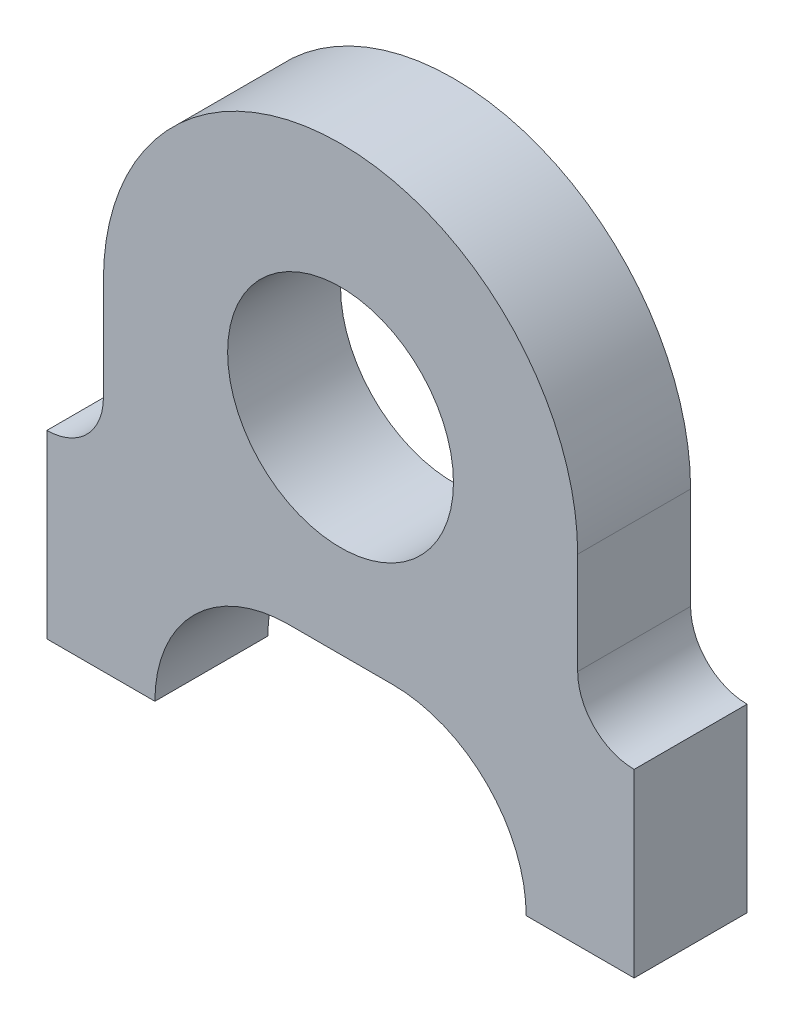
ISO-10303-21;
HEADER;
FILE_DESCRIPTION(('STEP AP214'),'2;1');
FILE_NAME('part.step','',(''),(''),'','','');
FILE_SCHEMA(('AUTOMOTIVE_DESIGN { 1 0 10303 214 1 1 1 1 }'));
ENDSEC;
DATA;
#1=APPLICATION_CONTEXT('core data for automotive mechanical design processes');
#2=APPLICATION_PROTOCOL_DEFINITION('international standard','automotive_design',2000,#1);
#3=PRODUCT_CONTEXT('',#1,'mechanical');
#4=PRODUCT('Part','Part','',(#3));
#5=PRODUCT_RELATED_PRODUCT_CATEGORY('part','',(#4));
#6=PRODUCT_DEFINITION_FORMATION('','',#4);
#7=PRODUCT_DEFINITION_CONTEXT('part definition',#1,'design');
#8=PRODUCT_DEFINITION('design','',#6,#7);
#9=PRODUCT_DEFINITION_SHAPE('','',#8);
#10=(LENGTH_UNIT() NAMED_UNIT(*) SI_UNIT(.MILLI.,.METRE.));
#11=(NAMED_UNIT(*) PLANE_ANGLE_UNIT() SI_UNIT($,.RADIAN.));
#12=(NAMED_UNIT(*) SI_UNIT($,.STERADIAN.) SOLID_ANGLE_UNIT());
#13=UNCERTAINTY_MEASURE_WITH_UNIT(LENGTH_MEASURE(1.E-05),#10,'distance_accuracy_value','');
#14=(GEOMETRIC_REPRESENTATION_CONTEXT(3) GLOBAL_UNCERTAINTY_ASSIGNED_CONTEXT((#13)) GLOBAL_UNIT_ASSIGNED_CONTEXT((#10,
#11,#12)) REPRESENTATION_CONTEXT('',''));
#15=CARTESIAN_POINT('',(0.,0.,0.));
#16=DIRECTION('',(0.,0.,1.));
#17=DIRECTION('',(1.,0.,0.));
#18=AXIS2_PLACEMENT_3D('',#15,#16,#17);
#19=CARTESIAN_POINT('',(-16.51,-5.71499999999999,6.35));
#20=DIRECTION('',(0.,0.,1.));
#21=DIRECTION('',(1.,0.,0.));
#22=AXIS2_PLACEMENT_3D('',#19,#20,#21);
#23=PLANE('',#22);
#24=CARTESIAN_POINT('',(-16.51,-5.71499999999999,6.35));
#25=DIRECTION('',(0.,0.,-1.));
#26=DIRECTION('',(1.,0.,0.));
#27=AXIS2_PLACEMENT_3D('',#24,#25,#26);
#28=CIRCLE('',#27,3.17500000000001);
#29=CARTESIAN_POINT('',(-13.335,-5.71499999999999,6.35));
#30=VERTEX_POINT('',#29);
#31=CARTESIAN_POINT('',(-16.51,-8.89,6.35));
#32=VERTEX_POINT('',#31);
#33=EDGE_CURVE('E181',#30,#32,#28,.T.);
#34=ORIENTED_EDGE('',*,*,#33,.T.);
#35=DIRECTION('',(0.,-1.,0.));
#36=VECTOR('',#35,1.);
#37=CARTESIAN_POINT('',(-16.51,-8.89,6.35));
#38=LINE('',#37,#36);
#39=CARTESIAN_POINT('',(-16.51,-19.05,6.35));
#40=VERTEX_POINT('',#39);
#41=EDGE_CURVE('E107',#32,#40,#38,.T.);
#42=ORIENTED_EDGE('',*,*,#41,.T.);
#43=DIRECTION('',(1.,0.,0.));
#44=VECTOR('',#43,1.);
#45=CARTESIAN_POINT('',(-16.51,-19.05,6.35));
#46=LINE('',#45,#44);
#47=CARTESIAN_POINT('',(-10.4394,-19.05,6.35));
#48=VERTEX_POINT('',#47);
#49=EDGE_CURVE('E208',#40,#48,#46,.T.);
#50=ORIENTED_EDGE('',*,*,#49,.T.);
#51=CARTESIAN_POINT('',(-2.93763032034358,-19.05,6.35));
#52=DIRECTION('',(0.,0.,-1.));
#53=DIRECTION('',(-1.,0.,0.));
#54=AXIS2_PLACEMENT_3D('',#51,#52,#53);
#55=CIRCLE('',#54,7.50176967965642);
#56=CARTESIAN_POINT('',(-2.93763032034358,-11.5482303203436,6.35));
#57=VERTEX_POINT('',#56);
#58=EDGE_CURVE('E227',#48,#57,#55,.T.);
#59=ORIENTED_EDGE('',*,*,#58,.T.);
#60=DIRECTION('',(1.,0.,0.));
#61=VECTOR('',#60,1.);
#62=CARTESIAN_POINT('',(-2.93763032034358,-11.5482303203436,6.35));
#63=LINE('',#62,#61);
#64=CARTESIAN_POINT('',(2.93763032034358,-11.5482303203436,6.35));
#65=VERTEX_POINT('',#64);
#66=EDGE_CURVE('E224',#57,#65,#63,.T.);
#67=ORIENTED_EDGE('',*,*,#66,.T.);
#68=CARTESIAN_POINT('',(2.93763032034358,-19.05,6.35));
#69=DIRECTION('',(0.,0.,-1.));
#70=DIRECTION('',(1.,0.,0.));
#71=AXIS2_PLACEMENT_3D('',#68,#69,#70);
#72=CIRCLE('',#71,7.50176967965642);
#73=CARTESIAN_POINT('',(10.4394,-19.05,6.35));
#74=VERTEX_POINT('',#73);
#75=EDGE_CURVE('E226',#65,#74,#72,.T.);
#76=ORIENTED_EDGE('',*,*,#75,.T.);
#77=DIRECTION('',(1.,0.,0.));
#78=VECTOR('',#77,1.);
#79=CARTESIAN_POINT('',(10.4394,-19.05,6.35));
#80=LINE('',#79,#78);
#81=CARTESIAN_POINT('',(16.51,-19.05,6.35));
#82=VERTEX_POINT('',#81);
#83=EDGE_CURVE('E229',#74,#82,#80,.T.);
#84=ORIENTED_EDGE('',*,*,#83,.T.);
#85=DIRECTION('',(0.,1.,0.));
#86=VECTOR('',#85,1.);
#87=CARTESIAN_POINT('',(16.51,-8.89,6.35));
#88=LINE('',#87,#86);
#89=CARTESIAN_POINT('',(16.51,-8.89,6.35));
#90=VERTEX_POINT('',#89);
#91=EDGE_CURVE('E235',#82,#90,#88,.T.);
#92=ORIENTED_EDGE('',*,*,#91,.T.);
#93=CARTESIAN_POINT('',(16.51,-5.71499999999999,6.35));
#94=DIRECTION('',(0.,0.,-1.));
#95=DIRECTION('',(-1.,0.,0.));
#96=AXIS2_PLACEMENT_3D('',#93,#94,#95);
#97=CIRCLE('',#96,3.17500000000001);
#98=CARTESIAN_POINT('',(13.335,-5.71499999999999,6.35));
#99=VERTEX_POINT('',#98);
#100=EDGE_CURVE('E140',#90,#99,#97,.T.);
#101=ORIENTED_EDGE('',*,*,#100,.T.);
#102=DIRECTION('',(0.,1.,0.));
#103=VECTOR('',#102,1.);
#104=CARTESIAN_POINT('',(13.335,0.,6.35));
#105=LINE('',#104,#103);
#106=CARTESIAN_POINT('',(13.335,0.,6.35));
#107=VERTEX_POINT('',#106);
#108=EDGE_CURVE('E134',#99,#107,#105,.T.);
#109=ORIENTED_EDGE('',*,*,#108,.T.);
#110=CARTESIAN_POINT('',(0.,0.,6.35));
#111=DIRECTION('',(0.,0.,1.));
#112=DIRECTION('',(1.,0.,0.));
#113=AXIS2_PLACEMENT_3D('',#110,#111,#112);
#114=CIRCLE('',#113,13.335);
#115=CARTESIAN_POINT('',(-13.335,0.,6.35));
#116=VERTEX_POINT('',#115);
#117=EDGE_CURVE('E138',#107,#116,#114,.T.);
#118=ORIENTED_EDGE('',*,*,#117,.T.);
#119=DIRECTION('',(0.,-1.,0.));
#120=VECTOR('',#119,1.);
#121=CARTESIAN_POINT('',(-13.335,0.,6.35));
#122=LINE('',#121,#120);
#123=EDGE_CURVE('E51',#116,#30,#122,.T.);
#124=ORIENTED_EDGE('',*,*,#123,.T.);
#125=EDGE_LOOP('',(#34,#42,#50,#59,#67,#76,#84,#92,#101,#109,#118,#124));
#126=FACE_BOUND('',#125,.T.);
#127=CARTESIAN_POINT('',(0.,0.,6.35));
#128=DIRECTION('',(0.,0.,1.));
#129=DIRECTION('',(1.,0.,0.));
#130=AXIS2_PLACEMENT_3D('',#127,#128,#129);
#131=CIRCLE('',#130,6.35);
#132=CARTESIAN_POINT('',(6.35,0.,6.35));
#133=VERTEX_POINT('',#132);
#134=EDGE_CURVE('E162',#133,#133,#131,.T.);
#135=ORIENTED_EDGE('',*,*,#134,.F.);
#136=EDGE_LOOP('',(#135));
#137=FACE_BOUND('',#136,.T.);
#138=ADVANCED_FACE('F34',(#126,#137),#23,.T.);
#139=CARTESIAN_POINT('',(-16.51,-5.71499999999999,0.));
#140=DIRECTION('',(0.,0.,1.));
#141=DIRECTION('',(1.,0.,0.));
#142=AXIS2_PLACEMENT_3D('',#139,#140,#141);
#143=PLANE('',#142);
#144=CARTESIAN_POINT('',(-16.51,-5.71499999999999,0.));
#145=DIRECTION('',(0.,0.,-1.));
#146=DIRECTION('',(1.,0.,0.));
#147=AXIS2_PLACEMENT_3D('',#144,#145,#146);
#148=CIRCLE('',#147,3.17500000000001);
#149=CARTESIAN_POINT('',(-13.335,-5.71499999999999,0.));
#150=VERTEX_POINT('',#149);
#151=CARTESIAN_POINT('',(-16.51,-8.89,0.));
#152=VERTEX_POINT('',#151);
#153=EDGE_CURVE('E158',#150,#152,#148,.T.);
#154=ORIENTED_EDGE('',*,*,#153,.F.);
#155=DIRECTION('',(0.,-1.,0.));
#156=VECTOR('',#155,1.);
#157=CARTESIAN_POINT('',(-13.335,0.,0.));
#158=LINE('',#157,#156);
#159=CARTESIAN_POINT('',(-13.335,0.,0.));
#160=VERTEX_POINT('',#159);
#161=EDGE_CURVE('E99',#160,#150,#158,.T.);
#162=ORIENTED_EDGE('',*,*,#161,.F.);
#163=CARTESIAN_POINT('',(0.,0.,0.));
#164=DIRECTION('',(0.,0.,1.));
#165=DIRECTION('',(1.,0.,0.));
#166=AXIS2_PLACEMENT_3D('',#163,#164,#165);
#167=CIRCLE('',#166,13.335);
#168=CARTESIAN_POINT('',(13.335,0.,0.));
#169=VERTEX_POINT('',#168);
#170=EDGE_CURVE('E93',#169,#160,#167,.T.);
#171=ORIENTED_EDGE('',*,*,#170,.F.);
#172=DIRECTION('',(0.,1.,0.));
#173=VECTOR('',#172,1.);
#174=CARTESIAN_POINT('',(13.335,0.,0.));
#175=LINE('',#174,#173);
#176=CARTESIAN_POINT('',(13.335,-5.71499999999999,0.));
#177=VERTEX_POINT('',#176);
#178=EDGE_CURVE('E148',#177,#169,#175,.T.);
#179=ORIENTED_EDGE('',*,*,#178,.F.);
#180=CARTESIAN_POINT('',(16.51,-5.71499999999999,0.));
#181=DIRECTION('',(0.,0.,-1.));
#182=DIRECTION('',(-1.,0.,0.));
#183=AXIS2_PLACEMENT_3D('',#180,#181,#182);
#184=CIRCLE('',#183,3.17500000000001);
#185=CARTESIAN_POINT('',(16.51,-8.89,0.));
#186=VERTEX_POINT('',#185);
#187=EDGE_CURVE('E176',#186,#177,#184,.T.);
#188=ORIENTED_EDGE('',*,*,#187,.F.);
#189=DIRECTION('',(0.,1.,0.));
#190=VECTOR('',#189,1.);
#191=CARTESIAN_POINT('',(16.51,-8.89,0.));
#192=LINE('',#191,#190);
#193=CARTESIAN_POINT('',(16.51,-19.05,0.));
#194=VERTEX_POINT('',#193);
#195=EDGE_CURVE('E174',#194,#186,#192,.T.);
#196=ORIENTED_EDGE('',*,*,#195,.F.);
#197=DIRECTION('',(1.,0.,0.));
#198=VECTOR('',#197,1.);
#199=CARTESIAN_POINT('',(10.4394,-19.05,0.));
#200=LINE('',#199,#198);
#201=CARTESIAN_POINT('',(10.4394,-19.05,0.));
#202=VERTEX_POINT('',#201);
#203=EDGE_CURVE('E172',#202,#194,#200,.T.);
#204=ORIENTED_EDGE('',*,*,#203,.F.);
#205=CARTESIAN_POINT('',(2.93763032034358,-19.05,0.));
#206=DIRECTION('',(0.,0.,-1.));
#207=DIRECTION('',(1.,0.,0.));
#208=AXIS2_PLACEMENT_3D('',#205,#206,#207);
#209=CIRCLE('',#208,7.50176967965642);
#210=CARTESIAN_POINT('',(2.93763032034358,-11.5482303203436,0.));
#211=VERTEX_POINT('',#210);
#212=EDGE_CURVE('E170',#211,#202,#209,.T.);
#213=ORIENTED_EDGE('',*,*,#212,.F.);
#214=DIRECTION('',(1.,0.,0.));
#215=VECTOR('',#214,1.);
#216=CARTESIAN_POINT('',(-2.93763032034358,-11.5482303203436,0.));
#217=LINE('',#216,#215);
#218=CARTESIAN_POINT('',(-2.93763032034358,-11.5482303203436,0.));
#219=VERTEX_POINT('',#218);
#220=EDGE_CURVE('E168',#219,#211,#217,.T.);
#221=ORIENTED_EDGE('',*,*,#220,.F.);
#222=CARTESIAN_POINT('',(-2.93763032034358,-19.05,0.));
#223=DIRECTION('',(0.,0.,-1.));
#224=DIRECTION('',(-1.,0.,0.));
#225=AXIS2_PLACEMENT_3D('',#222,#223,#224);
#226=CIRCLE('',#225,7.50176967965642);
#227=CARTESIAN_POINT('',(-10.4394,-19.05,0.));
#228=VERTEX_POINT('',#227);
#229=EDGE_CURVE('E166',#228,#219,#226,.T.);
#230=ORIENTED_EDGE('',*,*,#229,.F.);
#231=DIRECTION('',(1.,0.,0.));
#232=VECTOR('',#231,1.);
#233=CARTESIAN_POINT('',(-16.51,-19.05,0.));
#234=LINE('',#233,#232);
#235=CARTESIAN_POINT('',(-16.51,-19.05,0.));
#236=VERTEX_POINT('',#235);
#237=EDGE_CURVE('E164',#236,#228,#234,.T.);
#238=ORIENTED_EDGE('',*,*,#237,.F.);
#239=DIRECTION('',(0.,-1.,0.));
#240=VECTOR('',#239,1.);
#241=CARTESIAN_POINT('',(-16.51,-8.89,0.));
#242=LINE('',#241,#240);
#243=EDGE_CURVE('E161',#152,#236,#242,.T.);
#244=ORIENTED_EDGE('',*,*,#243,.F.);
#245=EDGE_LOOP('',(#154,#162,#171,#179,#188,#196,#204,#213,#221,#230,#238,#244));
#246=FACE_BOUND('',#245,.T.);
#247=CARTESIAN_POINT('',(0.,0.,0.));
#248=DIRECTION('',(0.,0.,1.));
#249=DIRECTION('',(1.,0.,0.));
#250=AXIS2_PLACEMENT_3D('',#247,#248,#249);
#251=CIRCLE('',#250,6.35);
#252=CARTESIAN_POINT('',(6.35,0.,0.));
#253=VERTEX_POINT('',#252);
#254=EDGE_CURVE('E301',#253,#253,#251,.T.);
#255=ORIENTED_EDGE('',*,*,#254,.T.);
#256=EDGE_LOOP('',(#255));
#257=FACE_BOUND('',#256,.T.);
#258=ADVANCED_FACE('F212',(#246,#257),#143,.F.);
#259=CARTESIAN_POINT('',(-16.51,-5.71499999999999,6.35));
#260=DIRECTION('',(0.,0.,-1.));
#261=DIRECTION('',(-1.,0.,0.));
#262=AXIS2_PLACEMENT_3D('',#259,#260,#261);
#263=CYLINDRICAL_SURFACE('',#262,3.17500000000001);
#264=ORIENTED_EDGE('',*,*,#153,.T.);
#265=DIRECTION('',(0.,0.,-1.));
#266=VECTOR('',#265,1.);
#267=CARTESIAN_POINT('',(-16.51,-8.89,6.35));
#268=LINE('',#267,#266);
#269=EDGE_CURVE('E11',#32,#152,#268,.T.);
#270=ORIENTED_EDGE('',*,*,#269,.F.);
#271=ORIENTED_EDGE('',*,*,#33,.F.);
#272=DIRECTION('',(0.,0.,-1.));
#273=VECTOR('',#272,1.);
#274=CARTESIAN_POINT('',(-13.335,-5.71499999999999,6.35));
#275=LINE('',#274,#273);
#276=EDGE_CURVE('E154',#30,#150,#275,.T.);
#277=ORIENTED_EDGE('',*,*,#276,.T.);
#278=EDGE_LOOP('',(#264,#270,#271,#277));
#279=FACE_BOUND('',#278,.T.);
#280=ADVANCED_FACE('F36',(#279),#263,.F.);
#281=CARTESIAN_POINT('',(-16.51,-8.89,6.35));
#282=DIRECTION('',(1.,0.,0.));
#283=DIRECTION('',(0.,1.,0.));
#284=AXIS2_PLACEMENT_3D('',#281,#282,#283);
#285=PLANE('',#284);
#286=ORIENTED_EDGE('',*,*,#243,.T.);
#287=DIRECTION('',(0.,0.,-1.));
#288=VECTOR('',#287,1.);
#289=CARTESIAN_POINT('',(-16.51,-19.05,6.35));
#290=LINE('',#289,#288);
#291=EDGE_CURVE('E43',#40,#236,#290,.T.);
#292=ORIENTED_EDGE('',*,*,#291,.F.);
#293=ORIENTED_EDGE('',*,*,#41,.F.);
#294=ORIENTED_EDGE('',*,*,#269,.T.);
#295=EDGE_LOOP('',(#286,#292,#293,#294));
#296=FACE_BOUND('',#295,.T.);
#297=ADVANCED_FACE('F316',(#296),#285,.F.);
#298=CARTESIAN_POINT('',(-16.51,-19.05,6.35));
#299=DIRECTION('',(0.,1.,0.));
#300=DIRECTION('',(0.,0.,1.));
#301=AXIS2_PLACEMENT_3D('',#298,#299,#300);
#302=PLANE('',#301);
#303=CARTESIAN_POINT('',(-13.4747,-19.05,3.175));
#304=DIRECTION('',(0.,-1.,0.));
#305=DIRECTION('',(0.,0.,-1.));
#306=AXIS2_PLACEMENT_3D('',#303,#304,#305);
#307=CIRCLE('',#306,1.35255);
#308=CARTESIAN_POINT('',(-13.4747,-19.05,1.82245));
#309=VERTEX_POINT('',#308);
#310=EDGE_CURVE('E293',#309,#309,#307,.T.);
#311=ORIENTED_EDGE('',*,*,#310,.F.);
#312=EDGE_LOOP('',(#311));
#313=FACE_BOUND('',#312,.T.);
#314=ORIENTED_EDGE('',*,*,#237,.T.);
#315=DIRECTION('',(0.,0.,-1.));
#316=VECTOR('',#315,1.);
#317=CARTESIAN_POINT('',(-10.4394,-19.05,6.35));
#318=LINE('',#317,#316);
#319=EDGE_CURVE('E200',#48,#228,#318,.T.);
#320=ORIENTED_EDGE('',*,*,#319,.F.);
#321=ORIENTED_EDGE('',*,*,#49,.F.);
#322=ORIENTED_EDGE('',*,*,#291,.T.);
#323=EDGE_LOOP('',(#314,#320,#321,#322));
#324=FACE_BOUND('',#323,.T.);
#325=ADVANCED_FACE('F206',(#313,#324),#302,.F.);
#326=CARTESIAN_POINT('',(-2.93763032034358,-19.05,6.35));
#327=DIRECTION('',(0.,0.,-1.));
#328=DIRECTION('',(-1.,0.,0.));
#329=AXIS2_PLACEMENT_3D('',#326,#327,#328);
#330=CYLINDRICAL_SURFACE('',#329,7.50176967965642);
#331=ORIENTED_EDGE('',*,*,#229,.T.);
#332=DIRECTION('',(0.,0.,-1.));
#333=VECTOR('',#332,1.);
#334=CARTESIAN_POINT('',(-2.93763032034358,-11.5482303203436,6.35));
#335=LINE('',#334,#333);
#336=EDGE_CURVE('E197',#57,#219,#335,.T.);
#337=ORIENTED_EDGE('',*,*,#336,.F.);
#338=ORIENTED_EDGE('',*,*,#58,.F.);
#339=ORIENTED_EDGE('',*,*,#319,.T.);
#340=EDGE_LOOP('',(#331,#337,#338,#339));
#341=FACE_BOUND('',#340,.T.);
#342=ADVANCED_FACE('F218',(#341),#330,.F.);
#343=CARTESIAN_POINT('',(-2.93763032034358,-11.5482303203436,6.35));
#344=DIRECTION('',(0.,1.,0.));
#345=DIRECTION('',(0.,0.,1.));
#346=AXIS2_PLACEMENT_3D('',#343,#344,#345);
#347=PLANE('',#346);
#348=ORIENTED_EDGE('',*,*,#220,.T.);
#349=DIRECTION('',(0.,0.,-1.));
#350=VECTOR('',#349,1.);
#351=CARTESIAN_POINT('',(2.93763032034358,-11.5482303203436,6.35));
#352=LINE('',#351,#350);
#353=EDGE_CURVE('E194',#65,#211,#352,.T.);
#354=ORIENTED_EDGE('',*,*,#353,.F.);
#355=ORIENTED_EDGE('',*,*,#66,.F.);
#356=ORIENTED_EDGE('',*,*,#336,.T.);
#357=EDGE_LOOP('',(#348,#354,#355,#356));
#358=FACE_BOUND('',#357,.T.);
#359=ADVANCED_FACE('F222',(#358),#347,.F.);
#360=CARTESIAN_POINT('',(2.93763032034358,-19.05,6.35));
#361=DIRECTION('',(0.,0.,-1.));
#362=DIRECTION('',(-1.,0.,0.));
#363=AXIS2_PLACEMENT_3D('',#360,#361,#362);
#364=CYLINDRICAL_SURFACE('',#363,7.50176967965642);
#365=ORIENTED_EDGE('',*,*,#212,.T.);
#366=DIRECTION('',(0.,0.,-1.));
#367=VECTOR('',#366,1.);
#368=CARTESIAN_POINT('',(10.4394,-19.05,6.35));
#369=LINE('',#368,#367);
#370=EDGE_CURVE('E191',#74,#202,#369,.T.);
#371=ORIENTED_EDGE('',*,*,#370,.F.);
#372=ORIENTED_EDGE('',*,*,#75,.F.);
#373=ORIENTED_EDGE('',*,*,#353,.T.);
#374=EDGE_LOOP('',(#365,#371,#372,#373));
#375=FACE_BOUND('',#374,.T.);
#376=ADVANCED_FACE('F326',(#375),#364,.F.);
#377=CARTESIAN_POINT('',(10.4394,-19.05,6.35));
#378=DIRECTION('',(0.,1.,0.));
#379=DIRECTION('',(0.,0.,1.));
#380=AXIS2_PLACEMENT_3D('',#377,#378,#379);
#381=PLANE('',#380);
#382=CARTESIAN_POINT('',(13.4747,-19.05,3.175));
#383=DIRECTION('',(0.,-1.,0.));
#384=DIRECTION('',(0.,0.,-1.));
#385=AXIS2_PLACEMENT_3D('',#382,#383,#384);
#386=CIRCLE('',#385,1.35255);
#387=CARTESIAN_POINT('',(13.4747,-19.05,1.82245));
#388=VERTEX_POINT('',#387);
#389=EDGE_CURVE('E290',#388,#388,#386,.T.);
#390=ORIENTED_EDGE('',*,*,#389,.F.);
#391=EDGE_LOOP('',(#390));
#392=FACE_BOUND('',#391,.T.);
#393=ORIENTED_EDGE('',*,*,#203,.T.);
#394=DIRECTION('',(0.,0.,-1.));
#395=VECTOR('',#394,1.);
#396=CARTESIAN_POINT('',(16.51,-19.05,6.35));
#397=LINE('',#396,#395);
#398=EDGE_CURVE('E188',#82,#194,#397,.T.);
#399=ORIENTED_EDGE('',*,*,#398,.F.);
#400=ORIENTED_EDGE('',*,*,#83,.F.);
#401=ORIENTED_EDGE('',*,*,#370,.T.);
#402=EDGE_LOOP('',(#393,#399,#400,#401));
#403=FACE_BOUND('',#402,.T.);
#404=ADVANCED_FACE('F329',(#392,#403),#381,.F.);
#405=CARTESIAN_POINT('',(16.51,-8.89,6.35));
#406=DIRECTION('',(-1.,0.,0.));
#407=DIRECTION('',(0.,0.,1.));
#408=AXIS2_PLACEMENT_3D('',#405,#406,#407);
#409=PLANE('',#408);
#410=ORIENTED_EDGE('',*,*,#195,.T.);
#411=DIRECTION('',(0.,0.,-1.));
#412=VECTOR('',#411,1.);
#413=CARTESIAN_POINT('',(16.51,-8.89,6.35));
#414=LINE('',#413,#412);
#415=EDGE_CURVE('E185',#90,#186,#414,.T.);
#416=ORIENTED_EDGE('',*,*,#415,.F.);
#417=ORIENTED_EDGE('',*,*,#91,.F.);
#418=ORIENTED_EDGE('',*,*,#398,.T.);
#419=EDGE_LOOP('',(#410,#416,#417,#418));
#420=FACE_BOUND('',#419,.T.);
#421=ADVANCED_FACE('F241',(#420),#409,.F.);
#422=CARTESIAN_POINT('',(16.51,-5.71499999999999,6.35));
#423=DIRECTION('',(0.,0.,-1.));
#424=DIRECTION('',(-1.,0.,0.));
#425=AXIS2_PLACEMENT_3D('',#422,#423,#424);
#426=CYLINDRICAL_SURFACE('',#425,3.17500000000001);
#427=ORIENTED_EDGE('',*,*,#187,.T.);
#428=DIRECTION('',(0.,0.,-1.));
#429=VECTOR('',#428,1.);
#430=CARTESIAN_POINT('',(13.335,-5.71499999999999,6.35));
#431=LINE('',#430,#429);
#432=EDGE_CURVE('E149',#99,#177,#431,.T.);
#433=ORIENTED_EDGE('',*,*,#432,.F.);
#434=ORIENTED_EDGE('',*,*,#100,.F.);
#435=ORIENTED_EDGE('',*,*,#415,.T.);
#436=EDGE_LOOP('',(#427,#433,#434,#435));
#437=FACE_BOUND('',#436,.T.);
#438=ADVANCED_FACE('F245',(#437),#426,.F.);
#439=CARTESIAN_POINT('',(13.335,0.,6.35));
#440=DIRECTION('',(-1.,0.,0.));
#441=DIRECTION('',(0.,0.,1.));
#442=AXIS2_PLACEMENT_3D('',#439,#440,#441);
#443=PLANE('',#442);
#444=ORIENTED_EDGE('',*,*,#178,.T.);
#445=DIRECTION('',(0.,0.,-1.));
#446=VECTOR('',#445,1.);
#447=CARTESIAN_POINT('',(13.335,0.,6.35));
#448=LINE('',#447,#446);
#449=EDGE_CURVE('E145',#107,#169,#448,.T.);
#450=ORIENTED_EDGE('',*,*,#449,.F.);
#451=ORIENTED_EDGE('',*,*,#108,.F.);
#452=ORIENTED_EDGE('',*,*,#432,.T.);
#453=EDGE_LOOP('',(#444,#450,#451,#452));
#454=FACE_BOUND('',#453,.T.);
#455=ADVANCED_FACE('F146',(#454),#443,.F.);
#456=CARTESIAN_POINT('',(0.,0.,6.35));
#457=DIRECTION('',(0.,0.,-1.));
#458=DIRECTION('',(-1.,0.,0.));
#459=AXIS2_PLACEMENT_3D('',#456,#457,#458);
#460=CYLINDRICAL_SURFACE('',#459,13.335);
#461=ORIENTED_EDGE('',*,*,#170,.T.);
#462=DIRECTION('',(0.,0.,-1.));
#463=VECTOR('',#462,1.);
#464=CARTESIAN_POINT('',(-13.335,0.,6.35));
#465=LINE('',#464,#463);
#466=EDGE_CURVE('E150',#116,#160,#465,.T.);
#467=ORIENTED_EDGE('',*,*,#466,.F.);
#468=ORIENTED_EDGE('',*,*,#117,.F.);
#469=ORIENTED_EDGE('',*,*,#449,.T.);
#470=EDGE_LOOP('',(#461,#467,#468,#469));
#471=FACE_BOUND('',#470,.T.);
#472=ADVANCED_FACE('F152',(#471),#460,.T.);
#473=CARTESIAN_POINT('',(-13.335,0.,6.35));
#474=DIRECTION('',(1.,0.,0.));
#475=DIRECTION('',(0.,0.,-1.));
#476=AXIS2_PLACEMENT_3D('',#473,#474,#475);
#477=PLANE('',#476);
#478=ORIENTED_EDGE('',*,*,#161,.T.);
#479=ORIENTED_EDGE('',*,*,#276,.F.);
#480=ORIENTED_EDGE('',*,*,#123,.F.);
#481=ORIENTED_EDGE('',*,*,#466,.T.);
#482=EDGE_LOOP('',(#478,#479,#480,#481));
#483=FACE_BOUND('',#482,.T.);
#484=ADVANCED_FACE('F249',(#483),#477,.F.);
#485=CARTESIAN_POINT('',(0.,0.,6.35));
#486=DIRECTION('',(0.,0.,-1.));
#487=DIRECTION('',(-1.,0.,0.));
#488=AXIS2_PLACEMENT_3D('',#485,#486,#487);
#489=CYLINDRICAL_SURFACE('',#488,6.35);
#490=ORIENTED_EDGE('',*,*,#134,.T.);
#491=EDGE_LOOP('',(#490));
#492=FACE_BOUND('',#491,.T.);
#493=ORIENTED_EDGE('',*,*,#254,.F.);
#494=EDGE_LOOP('',(#493));
#495=FACE_BOUND('',#494,.T.);
#496=ADVANCED_FACE('F251',(#492,#495),#489,.F.);
#497=CARTESIAN_POINT('',(-13.4747,-11.43,3.175));
#498=DIRECTION('',(0.,-1.,0.));
#499=DIRECTION('',(0.,0.,-1.));
#500=AXIS2_PLACEMENT_3D('',#497,#498,#499);
#501=CONICAL_SURFACE('',#500,1.35255,1.02974425867665);
#502=CARTESIAN_POINT('',(-13.4747,-10.6173059697343,3.175));
#503=VERTEX_POINT('',#502);
#504=VERTEX_LOOP('',#503);
#505=FACE_BOUND('',#504,.T.);
#506=CARTESIAN_POINT('',(-13.4747,-11.43,3.175));
#507=DIRECTION('',(0.,-1.,0.));
#508=DIRECTION('',(0.,0.,-1.));
#509=AXIS2_PLACEMENT_3D('',#506,#507,#508);
#510=CIRCLE('',#509,1.35255);
#511=CARTESIAN_POINT('',(-13.4747,-11.43,1.82245));
#512=VERTEX_POINT('',#511);
#513=EDGE_CURVE('E298',#512,#512,#510,.T.);
#514=ORIENTED_EDGE('',*,*,#513,.T.);
#515=EDGE_LOOP('',(#514));
#516=FACE_BOUND('',#515,.T.);
#517=ADVANCED_FACE('F257',(#505,#516),#501,.F.);
#518=CARTESIAN_POINT('',(-13.4747,-19.05,3.175));
#519=DIRECTION('',(0.,-1.,0.));
#520=DIRECTION('',(0.,0.,-1.));
#521=AXIS2_PLACEMENT_3D('',#518,#519,#520);
#522=CYLINDRICAL_SURFACE('',#521,1.35255);
#523=ORIENTED_EDGE('',*,*,#513,.F.);
#524=EDGE_LOOP('',(#523));
#525=FACE_BOUND('',#524,.T.);
#526=ORIENTED_EDGE('',*,*,#310,.T.);
#527=EDGE_LOOP('',(#526));
#528=FACE_BOUND('',#527,.T.);
#529=ADVANCED_FACE('F270',(#525,#528),#522,.F.);
#530=CARTESIAN_POINT('',(13.4747,-11.43,3.175));
#531=DIRECTION('',(0.,-1.,0.));
#532=DIRECTION('',(0.,0.,-1.));
#533=AXIS2_PLACEMENT_3D('',#530,#531,#532);
#534=CONICAL_SURFACE('',#533,1.35255,1.02974425867665);
#535=CARTESIAN_POINT('',(13.4747,-10.6173059697343,3.175));
#536=VERTEX_POINT('',#535);
#537=VERTEX_LOOP('',#536);
#538=FACE_BOUND('',#537,.T.);
#539=CARTESIAN_POINT('',(13.4747,-11.43,3.175));
#540=DIRECTION('',(0.,-1.,0.));
#541=DIRECTION('',(0.,0.,-1.));
#542=AXIS2_PLACEMENT_3D('',#539,#540,#541);
#543=CIRCLE('',#542,1.35255);
#544=CARTESIAN_POINT('',(13.4747,-11.43,1.82245));
#545=VERTEX_POINT('',#544);
#546=EDGE_CURVE('E287',#545,#545,#543,.T.);
#547=ORIENTED_EDGE('',*,*,#546,.T.);
#548=EDGE_LOOP('',(#547));
#549=FACE_BOUND('',#548,.T.);
#550=ADVANCED_FACE('F274',(#538,#549),#534,.F.);
#551=CARTESIAN_POINT('',(13.4747,-19.05,3.175));
#552=DIRECTION('',(0.,-1.,0.));
#553=DIRECTION('',(0.,0.,-1.));
#554=AXIS2_PLACEMENT_3D('',#551,#552,#553);
#555=CYLINDRICAL_SURFACE('',#554,1.35255);
#556=ORIENTED_EDGE('',*,*,#546,.F.);
#557=EDGE_LOOP('',(#556));
#558=FACE_BOUND('',#557,.T.);
#559=ORIENTED_EDGE('',*,*,#389,.T.);
#560=EDGE_LOOP('',(#559));
#561=FACE_BOUND('',#560,.T.);
#562=ADVANCED_FACE('F278',(#558,#561),#555,.F.);
#563=CLOSED_SHELL('',(#138,#258,#280,#297,#325,#342,#359,#376,#404,#421,#438,#455,#472,#484,
#496,#517,#529,#550,#562));
#564=MANIFOLD_SOLID_BREP('B2',#563);
#565=ADVANCED_BREP_SHAPE_REPRESENTATION('',(#18,#564),#14);
#566=SHAPE_DEFINITION_REPRESENTATION(#9,#565);
ENDSEC;
END-ISO-10303-21;
